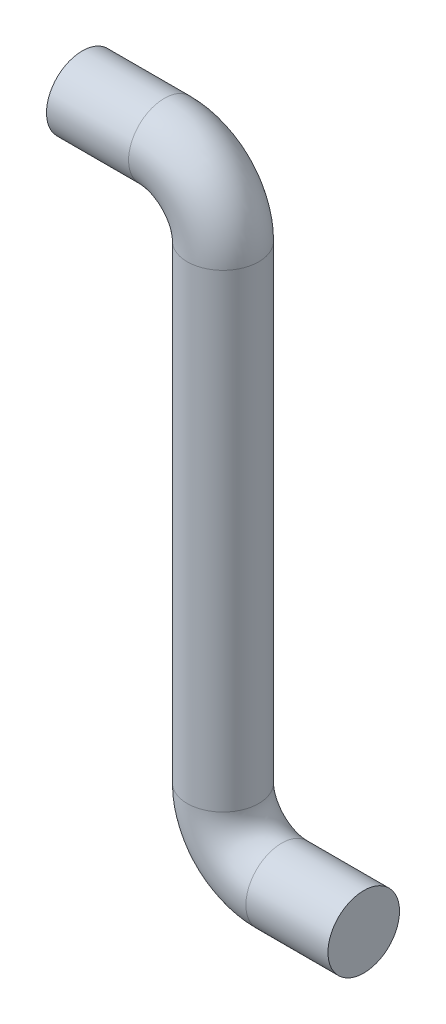
ISO-10303-21;
HEADER;
FILE_DESCRIPTION(('STEP AP214'),'2;1');
FILE_NAME('part.step','',(''),(''),'','','');
FILE_SCHEMA(('AUTOMOTIVE_DESIGN { 1 0 10303 214 1 1 1 1 }'));
ENDSEC;
DATA;
#1=APPLICATION_CONTEXT('core data for automotive mechanical design processes');
#2=APPLICATION_PROTOCOL_DEFINITION('international standard','automotive_design',2000,#1);
#3=PRODUCT_CONTEXT('',#1,'mechanical');
#4=PRODUCT('Part','Part','',(#3));
#5=PRODUCT_RELATED_PRODUCT_CATEGORY('part','',(#4));
#6=PRODUCT_DEFINITION_FORMATION('','',#4);
#7=PRODUCT_DEFINITION_CONTEXT('part definition',#1,'design');
#8=PRODUCT_DEFINITION('design','',#6,#7);
#9=PRODUCT_DEFINITION_SHAPE('','',#8);
#10=(LENGTH_UNIT() NAMED_UNIT(*) SI_UNIT(.MILLI.,.METRE.));
#11=(NAMED_UNIT(*) PLANE_ANGLE_UNIT() SI_UNIT($,.RADIAN.));
#12=(NAMED_UNIT(*) SI_UNIT($,.STERADIAN.) SOLID_ANGLE_UNIT());
#13=UNCERTAINTY_MEASURE_WITH_UNIT(LENGTH_MEASURE(1.E-05),#10,'distance_accuracy_value','');
#14=(GEOMETRIC_REPRESENTATION_CONTEXT(3) GLOBAL_UNCERTAINTY_ASSIGNED_CONTEXT((#13)) GLOBAL_UNIT_ASSIGNED_CONTEXT((#10,
#11,#12)) REPRESENTATION_CONTEXT('',''));
#15=CARTESIAN_POINT('',(0.,0.,0.));
#16=DIRECTION('',(0.,0.,1.));
#17=DIRECTION('',(1.,0.,0.));
#18=AXIS2_PLACEMENT_3D('',#15,#16,#17);
#19=CARTESIAN_POINT('',(0.,0.,0.));
#20=DIRECTION('',(1.,0.,0.));
#21=DIRECTION('',(0.,0.,-1.));
#22=AXIS2_PLACEMENT_3D('',#19,#20,#21);
#23=PLANE('',#22);
#24=CARTESIAN_POINT('',(0.,0.,0.));
#25=DIRECTION('',(1.,0.,0.));
#26=DIRECTION('',(0.,0.,-1.));
#27=AXIS2_PLACEMENT_3D('',#24,#25,#26);
#28=CIRCLE('',#27,3.05);
#29=CARTESIAN_POINT('',(0.,0.,-3.05));
#30=VERTEX_POINT('',#29);
#31=EDGE_CURVE('E68',#30,#30,#28,.T.);
#32=ORIENTED_EDGE('',*,*,#31,.T.);
#33=EDGE_LOOP('',(#32));
#34=FACE_BOUND('',#33,.T.);
#35=ADVANCED_FACE('F41',(#34),#23,.T.);
#36=CARTESIAN_POINT('',(-24.,50.,0.));
#37=DIRECTION('',(1.,0.,0.));
#38=DIRECTION('',(0.,0.,-1.));
#39=AXIS2_PLACEMENT_3D('',#36,#37,#38);
#40=PLANE('',#39);
#41=CARTESIAN_POINT('',(-24.,50.,0.));
#42=DIRECTION('',(1.,0.,0.));
#43=DIRECTION('',(0.,0.,-1.));
#44=AXIS2_PLACEMENT_3D('',#41,#42,#43);
#45=CIRCLE('',#44,3.05);
#46=CARTESIAN_POINT('',(-24.,50.,-3.05));
#47=VERTEX_POINT('',#46);
#48=EDGE_CURVE('E10',#47,#47,#45,.T.);
#49=ORIENTED_EDGE('',*,*,#48,.F.);
#50=EDGE_LOOP('',(#49));
#51=FACE_BOUND('',#50,.T.);
#52=ADVANCED_FACE('F77',(#51),#40,.F.);
#53=CARTESIAN_POINT('',(0.,0.,0.));
#54=DIRECTION('',(-1.,0.,0.));
#55=DIRECTION('',(0.,-1.,0.));
#56=AXIS2_PLACEMENT_3D('',#53,#54,#55);
#57=CYLINDRICAL_SURFACE('',#56,3.05);
#58=CARTESIAN_POINT('',(-7.,0.,0.));
#59=DIRECTION('',(1.,0.,0.));
#60=DIRECTION('',(0.,0.,-1.));
#61=AXIS2_PLACEMENT_3D('',#58,#59,#60);
#62=CIRCLE('',#61,3.05);
#63=CARTESIAN_POINT('',(-7.,-3.05,0.));
#64=VERTEX_POINT('',#63);
#65=EDGE_CURVE('E64',#64,#64,#62,.T.);
#66=ORIENTED_EDGE('',*,*,#65,.T.);
#67=EDGE_LOOP('',(#66));
#68=FACE_BOUND('',#67,.T.);
#69=ORIENTED_EDGE('',*,*,#31,.F.);
#70=EDGE_LOOP('',(#69));
#71=FACE_BOUND('',#70,.T.);
#72=ADVANCED_FACE('F74',(#68,#71),#57,.T.);
#73=CARTESIAN_POINT('',(-7.,5.,0.));
#74=DIRECTION('',(0.,0.,-1.));
#75=DIRECTION('',(-1.,0.,0.));
#76=AXIS2_PLACEMENT_3D('',#73,#74,#75);
#77=TOROIDAL_SURFACE('',#76,5.,3.05);
#78=CARTESIAN_POINT('',(-12.,5.,0.));
#79=DIRECTION('',(0.,-1.,0.));
#80=DIRECTION('',(0.,0.,-1.));
#81=AXIS2_PLACEMENT_3D('',#78,#79,#80);
#82=CIRCLE('',#81,3.05);
#83=CARTESIAN_POINT('',(-15.05,5.,0.));
#84=VERTEX_POINT('',#83);
#85=EDGE_CURVE('E58',#84,#84,#82,.T.);
#86=CARTESIAN_POINT('',(-7.,5.,0.));
#87=DIRECTION('',(0.,0.,-1.));
#88=DIRECTION('',(-1.,0.,0.));
#89=AXIS2_PLACEMENT_3D('',#86,#87,#88);
#90=CIRCLE('',#89,8.05);
#91=EDGE_CURVE('',#64,#84,#90,.T.);
#92=ORIENTED_EDGE('',*,*,#65,.F.);
#93=ORIENTED_EDGE('',*,*,#85,.T.);
#94=ORIENTED_EDGE('',*,*,#91,.T.);
#95=ORIENTED_EDGE('',*,*,#91,.F.);
#96=EDGE_LOOP('',(#92,#94,#93,#95));
#97=FACE_BOUND('',#96,.T.);
#98=ADVANCED_FACE('F76',(#97),#77,.T.);
#99=CARTESIAN_POINT('',(-12.,5.,0.));
#100=DIRECTION('',(0.,1.,0.));
#101=DIRECTION('',(-1.,0.,0.));
#102=AXIS2_PLACEMENT_3D('',#99,#100,#101);
#103=CYLINDRICAL_SURFACE('',#102,3.05);
#104=CARTESIAN_POINT('',(-12.,45.,0.));
#105=DIRECTION('',(0.,-1.,0.));
#106=DIRECTION('',(0.,0.,-1.));
#107=AXIS2_PLACEMENT_3D('',#104,#105,#106);
#108=CIRCLE('',#107,3.05);
#109=CARTESIAN_POINT('',(-8.95,45.,0.));
#110=VERTEX_POINT('',#109);
#111=EDGE_CURVE('E53',#110,#110,#108,.T.);
#112=ORIENTED_EDGE('',*,*,#111,.T.);
#113=EDGE_LOOP('',(#112));
#114=FACE_BOUND('',#113,.T.);
#115=ORIENTED_EDGE('',*,*,#85,.F.);
#116=EDGE_LOOP('',(#115));
#117=FACE_BOUND('',#116,.T.);
#118=ADVANCED_FACE('F84',(#114,#117),#103,.T.);
#119=CARTESIAN_POINT('',(-17.,45.,0.));
#120=DIRECTION('',(0.,0.,1.));
#121=DIRECTION('',(1.,0.,0.));
#122=AXIS2_PLACEMENT_3D('',#119,#120,#121);
#123=TOROIDAL_SURFACE('',#122,5.,3.05);
#124=CARTESIAN_POINT('',(-17.,50.,0.));
#125=DIRECTION('',(1.,0.,0.));
#126=DIRECTION('',(0.,0.,-1.));
#127=AXIS2_PLACEMENT_3D('',#124,#125,#126);
#128=CIRCLE('',#127,3.05);
#129=CARTESIAN_POINT('',(-17.,53.05,0.));
#130=VERTEX_POINT('',#129);
#131=EDGE_CURVE('E48',#130,#130,#128,.T.);
#132=CARTESIAN_POINT('',(-17.,45.,0.));
#133=DIRECTION('',(0.,0.,1.));
#134=DIRECTION('',(1.,0.,0.));
#135=AXIS2_PLACEMENT_3D('',#132,#133,#134);
#136=CIRCLE('',#135,8.05);
#137=EDGE_CURVE('',#110,#130,#136,.T.);
#138=ORIENTED_EDGE('',*,*,#111,.F.);
#139=ORIENTED_EDGE('',*,*,#131,.T.);
#140=ORIENTED_EDGE('',*,*,#137,.T.);
#141=ORIENTED_EDGE('',*,*,#137,.F.);
#142=EDGE_LOOP('',(#138,#140,#139,#141));
#143=FACE_BOUND('',#142,.T.);
#144=ADVANCED_FACE('F90',(#143),#123,.T.);
#145=CARTESIAN_POINT('',(-17.,50.,0.));
#146=DIRECTION('',(-1.,0.,0.));
#147=DIRECTION('',(0.,0.,1.));
#148=AXIS2_PLACEMENT_3D('',#145,#146,#147);
#149=CYLINDRICAL_SURFACE('',#148,3.05);
#150=ORIENTED_EDGE('',*,*,#48,.T.);
#151=EDGE_LOOP('',(#150));
#152=FACE_BOUND('',#151,.T.);
#153=ORIENTED_EDGE('',*,*,#131,.F.);
#154=EDGE_LOOP('',(#153));
#155=FACE_BOUND('',#154,.T.);
#156=ADVANCED_FACE('F88',(#152,#155),#149,.T.);
#157=CLOSED_SHELL('',(#35,#52,#72,#98,#118,#144,#156));
#158=MANIFOLD_SOLID_BREP('B2',#157);
#159=ADVANCED_BREP_SHAPE_REPRESENTATION('',(#18,#158),#14);
#160=SHAPE_DEFINITION_REPRESENTATION(#9,#159);
ENDSEC;
END-ISO-10303-21;
